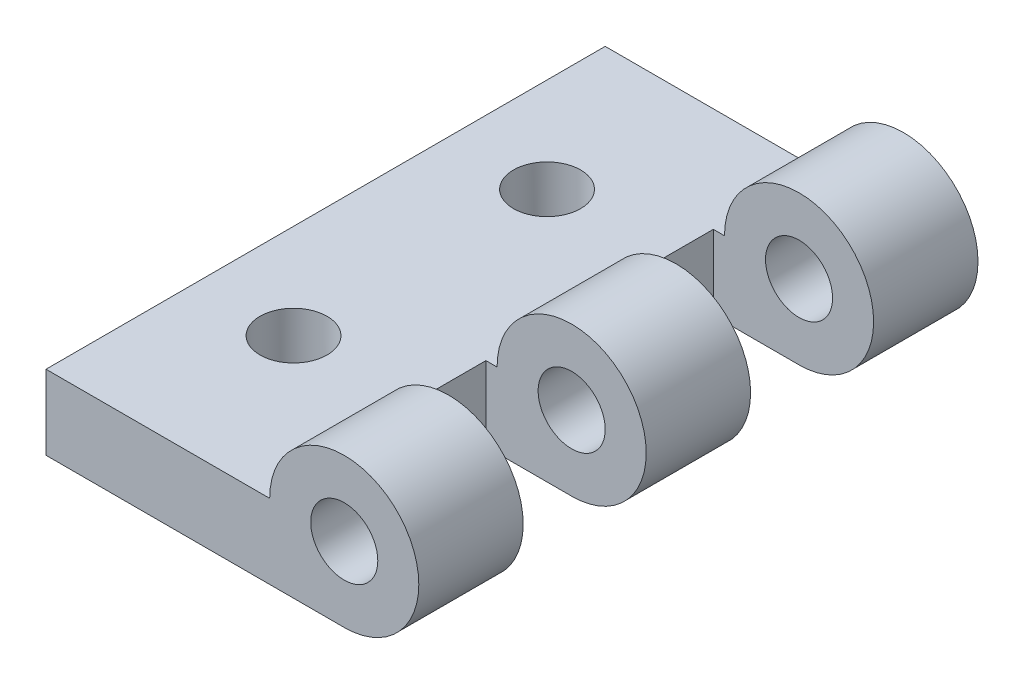
ISO-10303-21;
HEADER;
FILE_DESCRIPTION(('STEP AP214'),'2;1');
FILE_NAME('part.step','',(''),(''),'','','');
FILE_SCHEMA(('AUTOMOTIVE_DESIGN { 1 0 10303 214 1 1 1 1 }'));
ENDSEC;
DATA;
#1=APPLICATION_CONTEXT('core data for automotive mechanical design processes');
#2=APPLICATION_PROTOCOL_DEFINITION('international standard','automotive_design',2000,#1);
#3=PRODUCT_CONTEXT('',#1,'mechanical');
#4=PRODUCT('Part','Part','',(#3));
#5=PRODUCT_RELATED_PRODUCT_CATEGORY('part','',(#4));
#6=PRODUCT_DEFINITION_FORMATION('','',#4);
#7=PRODUCT_DEFINITION_CONTEXT('part definition',#1,'design');
#8=PRODUCT_DEFINITION('design','',#6,#7);
#9=PRODUCT_DEFINITION_SHAPE('','',#8);
#10=(LENGTH_UNIT() NAMED_UNIT(*) SI_UNIT(.MILLI.,.METRE.));
#11=(NAMED_UNIT(*) PLANE_ANGLE_UNIT() SI_UNIT($,.RADIAN.));
#12=(NAMED_UNIT(*) SI_UNIT($,.STERADIAN.) SOLID_ANGLE_UNIT());
#13=UNCERTAINTY_MEASURE_WITH_UNIT(LENGTH_MEASURE(1.E-05),#10,'distance_accuracy_value','');
#14=(GEOMETRIC_REPRESENTATION_CONTEXT(3) GLOBAL_UNCERTAINTY_ASSIGNED_CONTEXT((#13)) GLOBAL_UNIT_ASSIGNED_CONTEXT((#10,
#11,#12)) REPRESENTATION_CONTEXT('',''));
#15=CARTESIAN_POINT('',(0.,0.,0.));
#16=DIRECTION('',(0.,0.,1.));
#17=DIRECTION('',(1.,0.,0.));
#18=AXIS2_PLACEMENT_3D('',#15,#16,#17);
#19=CARTESIAN_POINT('',(20.32,5.08,38.1));
#20=DIRECTION('',(0.,0.,-1.));
#21=DIRECTION('',(-1.,0.,0.));
#22=AXIS2_PLACEMENT_3D('',#19,#20,#21);
#23=CYLINDRICAL_SURFACE('',#22,5.08);
#24=DIRECTION('',(0.,0.,-1.));
#25=VECTOR('',#24,1.);
#26=CARTESIAN_POINT('',(15.24,5.08,38.1));
#27=LINE('',#26,#25);
#28=CARTESIAN_POINT('',(15.24,5.08,7.112));
#29=VERTEX_POINT('',#28);
#30=CARTESIAN_POINT('',(15.24,5.08,0.));
#31=VERTEX_POINT('',#30);
#32=EDGE_CURVE('E252',#29,#31,#27,.T.);
#33=ORIENTED_EDGE('',*,*,#32,.F.);
#34=CARTESIAN_POINT('',(20.32,5.08,7.112));
#35=DIRECTION('',(0.,0.,-1.));
#36=DIRECTION('',(-1.,0.,0.));
#37=AXIS2_PLACEMENT_3D('',#34,#35,#36);
#38=CIRCLE('',#37,5.08);
#39=CARTESIAN_POINT('',(20.32,0.,7.112));
#40=VERTEX_POINT('',#39);
#41=EDGE_CURVE('E209',#29,#40,#38,.T.);
#42=ORIENTED_EDGE('',*,*,#41,.T.);
#43=DIRECTION('',(0.,0.,-1.));
#44=VECTOR('',#43,1.);
#45=CARTESIAN_POINT('',(20.32,0.,38.1));
#46=LINE('',#45,#44);
#47=CARTESIAN_POINT('',(20.32,0.,0.));
#48=VERTEX_POINT('',#47);
#49=EDGE_CURVE('E257',#40,#48,#46,.T.);
#50=ORIENTED_EDGE('',*,*,#49,.T.);
#51=CARTESIAN_POINT('',(20.32,5.08,0.));
#52=DIRECTION('',(0.,0.,1.));
#53=DIRECTION('',(1.,0.,0.));
#54=AXIS2_PLACEMENT_3D('',#51,#52,#53);
#55=CIRCLE('',#54,5.08);
#56=EDGE_CURVE('E243',#48,#31,#55,.T.);
#57=ORIENTED_EDGE('',*,*,#56,.T.);
#58=EDGE_LOOP('',(#33,#42,#50,#57));
#59=FACE_BOUND('',#58,.T.);
#60=ADVANCED_FACE('F39',(#59),#23,.T.);
#61=CARTESIAN_POINT('',(20.32,5.08,15.494));
#62=DIRECTION('',(0.,0.,1.));
#63=DIRECTION('',(1.,0.,0.));
#64=AXIS2_PLACEMENT_3D('',#61,#62,#63);
#65=CIRCLE('',#64,5.08);
#66=CARTESIAN_POINT('',(20.32,0.,15.494));
#67=VERTEX_POINT('',#66);
#68=CARTESIAN_POINT('',(15.24,5.08,15.494));
#69=VERTEX_POINT('',#68);
#70=EDGE_CURVE('E145',#67,#69,#65,.T.);
#71=ORIENTED_EDGE('',*,*,#70,.T.);
#72=CARTESIAN_POINT('',(15.24,5.08,22.606));
#73=VERTEX_POINT('',#72);
#74=EDGE_CURVE('E258',#73,#69,#27,.T.);
#75=ORIENTED_EDGE('',*,*,#74,.F.);
#76=CARTESIAN_POINT('',(20.32,5.08,22.606));
#77=DIRECTION('',(0.,0.,-1.));
#78=DIRECTION('',(-1.,0.,0.));
#79=AXIS2_PLACEMENT_3D('',#76,#77,#78);
#80=CIRCLE('',#79,5.08);
#81=CARTESIAN_POINT('',(20.32,0.,22.606));
#82=VERTEX_POINT('',#81);
#83=EDGE_CURVE('E195',#73,#82,#80,.T.);
#84=ORIENTED_EDGE('',*,*,#83,.T.);
#85=EDGE_CURVE('E264',#82,#67,#46,.T.);
#86=ORIENTED_EDGE('',*,*,#85,.T.);
#87=EDGE_LOOP('',(#71,#75,#84,#86));
#88=FACE_BOUND('',#87,.T.);
#89=ADVANCED_FACE('F315',(#88),#23,.T.);
#90=CARTESIAN_POINT('',(20.32,5.08,38.1));
#91=DIRECTION('',(0.,0.,-1.));
#92=DIRECTION('',(-1.,0.,0.));
#93=AXIS2_PLACEMENT_3D('',#90,#91,#92);
#94=CYLINDRICAL_SURFACE('',#93,2.286);
#95=CARTESIAN_POINT('',(20.32,5.08,7.112));
#96=DIRECTION('',(0.,0.,-1.));
#97=DIRECTION('',(-1.,0.,0.));
#98=AXIS2_PLACEMENT_3D('',#95,#96,#97);
#99=CIRCLE('',#98,2.286);
#100=CARTESIAN_POINT('',(18.034,5.08,7.112));
#101=VERTEX_POINT('',#100);
#102=EDGE_CURVE('E204',#101,#101,#99,.T.);
#103=ORIENTED_EDGE('',*,*,#102,.F.);
#104=EDGE_LOOP('',(#103));
#105=FACE_BOUND('',#104,.T.);
#106=CARTESIAN_POINT('',(20.32,5.08,0.));
#107=DIRECTION('',(0.,0.,1.));
#108=DIRECTION('',(1.,0.,0.));
#109=AXIS2_PLACEMENT_3D('',#106,#107,#108);
#110=CIRCLE('',#109,2.286);
#111=CARTESIAN_POINT('',(22.606,5.08,0.));
#112=VERTEX_POINT('',#111);
#113=EDGE_CURVE('E212',#112,#112,#110,.T.);
#114=ORIENTED_EDGE('',*,*,#113,.F.);
#115=EDGE_LOOP('',(#114));
#116=FACE_BOUND('',#115,.T.);
#117=ADVANCED_FACE('F322',(#105,#116),#94,.F.);
#118=CARTESIAN_POINT('',(20.32,5.08,38.1));
#119=DIRECTION('',(0.,0.,1.));
#120=DIRECTION('',(1.,0.,0.));
#121=AXIS2_PLACEMENT_3D('',#118,#119,#120);
#122=PLANE('',#121);
#123=DIRECTION('',(0.,-1.,0.));
#124=VECTOR('',#123,1.);
#125=CARTESIAN_POINT('',(0.,0.,38.1));
#126=LINE('',#125,#124);
#127=CARTESIAN_POINT('',(0.,5.08,38.1));
#128=VERTEX_POINT('',#127);
#129=CARTESIAN_POINT('',(0.,0.,38.1));
#130=VERTEX_POINT('',#129);
#131=EDGE_CURVE('E221',#128,#130,#126,.T.);
#132=ORIENTED_EDGE('',*,*,#131,.T.);
#133=DIRECTION('',(1.,0.,0.));
#134=VECTOR('',#133,1.);
#135=CARTESIAN_POINT('',(0.,0.,38.1));
#136=LINE('',#135,#134);
#137=CARTESIAN_POINT('',(20.32,0.,38.1));
#138=VERTEX_POINT('',#137);
#139=EDGE_CURVE('E225',#130,#138,#136,.T.);
#140=ORIENTED_EDGE('',*,*,#139,.T.);
#141=CARTESIAN_POINT('',(20.32,5.08,38.1));
#142=DIRECTION('',(0.,0.,1.));
#143=DIRECTION('',(1.,0.,0.));
#144=AXIS2_PLACEMENT_3D('',#141,#142,#143);
#145=CIRCLE('',#144,5.08);
#146=CARTESIAN_POINT('',(15.24,5.08,38.1));
#147=VERTEX_POINT('',#146);
#148=EDGE_CURVE('E229',#138,#147,#145,.T.);
#149=ORIENTED_EDGE('',*,*,#148,.T.);
#150=DIRECTION('',(-1.,0.,0.));
#151=VECTOR('',#150,1.);
#152=CARTESIAN_POINT('',(0.,5.08,38.1));
#153=LINE('',#152,#151);
#154=EDGE_CURVE('E232',#147,#128,#153,.T.);
#155=ORIENTED_EDGE('',*,*,#154,.T.);
#156=EDGE_LOOP('',(#132,#140,#149,#155));
#157=FACE_BOUND('',#156,.T.);
#158=CARTESIAN_POINT('',(20.32,5.08,38.1));
#159=DIRECTION('',(0.,0.,1.));
#160=DIRECTION('',(1.,0.,0.));
#161=AXIS2_PLACEMENT_3D('',#158,#159,#160);
#162=CIRCLE('',#161,2.286);
#163=CARTESIAN_POINT('',(22.606,5.08,38.1));
#164=VERTEX_POINT('',#163);
#165=EDGE_CURVE('E213',#164,#164,#162,.T.);
#166=ORIENTED_EDGE('',*,*,#165,.F.);
#167=EDGE_LOOP('',(#166));
#168=FACE_BOUND('',#167,.T.);
#169=ADVANCED_FACE('F344',(#157,#168),#122,.T.);
#170=CARTESIAN_POINT('',(20.32,5.08,0.));
#171=DIRECTION('',(0.,0.,1.));
#172=DIRECTION('',(1.,0.,0.));
#173=AXIS2_PLACEMENT_3D('',#170,#171,#172);
#174=PLANE('',#173);
#175=DIRECTION('',(0.,-1.,0.));
#176=VECTOR('',#175,1.);
#177=CARTESIAN_POINT('',(0.,0.,0.));
#178=LINE('',#177,#176);
#179=CARTESIAN_POINT('',(0.,5.08,0.));
#180=VERTEX_POINT('',#179);
#181=CARTESIAN_POINT('',(0.,0.,0.));
#182=VERTEX_POINT('',#181);
#183=EDGE_CURVE('E217',#180,#182,#178,.T.);
#184=ORIENTED_EDGE('',*,*,#183,.F.);
#185=DIRECTION('',(-1.,0.,0.));
#186=VECTOR('',#185,1.);
#187=CARTESIAN_POINT('',(0.,5.08,0.));
#188=LINE('',#187,#186);
#189=EDGE_CURVE('E226',#31,#180,#188,.T.);
#190=ORIENTED_EDGE('',*,*,#189,.F.);
#191=ORIENTED_EDGE('',*,*,#56,.F.);
#192=DIRECTION('',(1.,0.,0.));
#193=VECTOR('',#192,1.);
#194=CARTESIAN_POINT('',(0.,0.,0.));
#195=LINE('',#194,#193);
#196=EDGE_CURVE('E239',#182,#48,#195,.T.);
#197=ORIENTED_EDGE('',*,*,#196,.F.);
#198=EDGE_LOOP('',(#184,#190,#191,#197));
#199=FACE_BOUND('',#198,.T.);
#200=ORIENTED_EDGE('',*,*,#113,.T.);
#201=EDGE_LOOP('',(#200));
#202=FACE_BOUND('',#201,.T.);
#203=ADVANCED_FACE('F360',(#199,#202),#174,.F.);
#204=CARTESIAN_POINT('',(0.,0.,38.1));
#205=DIRECTION('',(1.,0.,0.));
#206=DIRECTION('',(0.,0.,-1.));
#207=AXIS2_PLACEMENT_3D('',#204,#205,#206);
#208=PLANE('',#207);
#209=ORIENTED_EDGE('',*,*,#183,.T.);
#210=DIRECTION('',(0.,0.,-1.));
#211=VECTOR('',#210,1.);
#212=CARTESIAN_POINT('',(0.,0.,38.1));
#213=LINE('',#212,#211);
#214=EDGE_CURVE('E263',#130,#182,#213,.T.);
#215=ORIENTED_EDGE('',*,*,#214,.F.);
#216=ORIENTED_EDGE('',*,*,#131,.F.);
#217=DIRECTION('',(0.,0.,-1.));
#218=VECTOR('',#217,1.);
#219=CARTESIAN_POINT('',(0.,5.08,38.1));
#220=LINE('',#219,#218);
#221=EDGE_CURVE('E235',#128,#180,#220,.T.);
#222=ORIENTED_EDGE('',*,*,#221,.T.);
#223=EDGE_LOOP('',(#209,#215,#216,#222));
#224=FACE_BOUND('',#223,.T.);
#225=ADVANCED_FACE('F41',(#224),#208,.F.);
#226=CARTESIAN_POINT('',(0.,0.,38.1));
#227=DIRECTION('',(0.,1.,0.));
#228=DIRECTION('',(0.,0.,1.));
#229=AXIS2_PLACEMENT_3D('',#226,#227,#228);
#230=PLANE('',#229);
#231=CARTESIAN_POINT('',(6.45160000000001,0.,10.414));
#232=DIRECTION('',(0.,1.,0.));
#233=DIRECTION('',(0.,0.,1.));
#234=AXIS2_PLACEMENT_3D('',#231,#232,#233);
#235=CIRCLE('',#234,2.286);
#236=CARTESIAN_POINT('',(6.45160000000001,0.,12.7));
#237=VERTEX_POINT('',#236);
#238=EDGE_CURVE('E285',#237,#237,#235,.T.);
#239=ORIENTED_EDGE('',*,*,#238,.T.);
#240=EDGE_LOOP('',(#239));
#241=FACE_BOUND('',#240,.T.);
#242=CARTESIAN_POINT('',(6.45160000000001,0.,27.686));
#243=DIRECTION('',(0.,1.,0.));
#244=DIRECTION('',(0.,0.,1.));
#245=AXIS2_PLACEMENT_3D('',#242,#243,#244);
#246=CIRCLE('',#245,2.286);
#247=CARTESIAN_POINT('',(6.45160000000001,0.,29.972));
#248=VERTEX_POINT('',#247);
#249=EDGE_CURVE('E161',#248,#248,#246,.T.);
#250=ORIENTED_EDGE('',*,*,#249,.T.);
#251=EDGE_LOOP('',(#250));
#252=FACE_BOUND('',#251,.T.);
#253=ORIENTED_EDGE('',*,*,#49,.F.);
#254=DIRECTION('',(-1.,0.,0.));
#255=VECTOR('',#254,1.);
#256=CARTESIAN_POINT('',(14.478,0.,7.112));
#257=LINE('',#256,#255);
#258=CARTESIAN_POINT('',(14.478,0.,7.112));
#259=VERTEX_POINT('',#258);
#260=EDGE_CURVE('E140',#40,#259,#257,.T.);
#261=ORIENTED_EDGE('',*,*,#260,.T.);
#262=DIRECTION('',(0.,0.,1.));
#263=VECTOR('',#262,1.);
#264=CARTESIAN_POINT('',(14.478,0.,7.112));
#265=LINE('',#264,#263);
#266=CARTESIAN_POINT('',(14.478,0.,15.494));
#267=VERTEX_POINT('',#266);
#268=EDGE_CURVE('E135',#259,#267,#265,.T.);
#269=ORIENTED_EDGE('',*,*,#268,.T.);
#270=DIRECTION('',(1.,0.,0.));
#271=VECTOR('',#270,1.);
#272=CARTESIAN_POINT('',(14.478,0.,15.494));
#273=LINE('',#272,#271);
#274=EDGE_CURVE('E143',#267,#67,#273,.T.);
#275=ORIENTED_EDGE('',*,*,#274,.T.);
#276=ORIENTED_EDGE('',*,*,#85,.F.);
#277=DIRECTION('',(-1.,0.,0.));
#278=VECTOR('',#277,1.);
#279=CARTESIAN_POINT('',(14.478,0.,22.606));
#280=LINE('',#279,#278);
#281=CARTESIAN_POINT('',(14.478,0.,22.606));
#282=VERTEX_POINT('',#281);
#283=EDGE_CURVE('E177',#82,#282,#280,.T.);
#284=ORIENTED_EDGE('',*,*,#283,.T.);
#285=DIRECTION('',(0.,0.,1.));
#286=VECTOR('',#285,1.);
#287=CARTESIAN_POINT('',(14.478,0.,22.606));
#288=LINE('',#287,#286);
#289=CARTESIAN_POINT('',(14.478,0.,30.988));
#290=VERTEX_POINT('',#289);
#291=EDGE_CURVE('E169',#282,#290,#288,.T.);
#292=ORIENTED_EDGE('',*,*,#291,.T.);
#293=DIRECTION('',(1.,0.,0.));
#294=VECTOR('',#293,1.);
#295=CARTESIAN_POINT('',(14.478,0.,30.988));
#296=LINE('',#295,#294);
#297=CARTESIAN_POINT('',(20.32,0.,30.988));
#298=VERTEX_POINT('',#297);
#299=EDGE_CURVE('E173',#290,#298,#296,.T.);
#300=ORIENTED_EDGE('',*,*,#299,.T.);
#301=EDGE_CURVE('E259',#138,#298,#46,.T.);
#302=ORIENTED_EDGE('',*,*,#301,.F.);
#303=ORIENTED_EDGE('',*,*,#139,.F.);
#304=ORIENTED_EDGE('',*,*,#214,.T.);
#305=ORIENTED_EDGE('',*,*,#196,.T.);
#306=EDGE_LOOP('',(#253,#261,#269,#275,#276,#284,#292,#300,#302,#303,#304,#305));
#307=FACE_BOUND('',#306,.T.);
#308=ADVANCED_FACE('F152',(#241,#252,#307),#230,.F.);
#309=CARTESIAN_POINT('',(20.32,5.08,30.988));
#310=DIRECTION('',(0.,0.,1.));
#311=DIRECTION('',(1.,0.,0.));
#312=AXIS2_PLACEMENT_3D('',#309,#310,#311);
#313=CIRCLE('',#312,5.08);
#314=CARTESIAN_POINT('',(15.24,5.08,30.988));
#315=VERTEX_POINT('',#314);
#316=EDGE_CURVE('E187',#298,#315,#313,.T.);
#317=ORIENTED_EDGE('',*,*,#316,.T.);
#318=EDGE_CURVE('E253',#147,#315,#27,.T.);
#319=ORIENTED_EDGE('',*,*,#318,.F.);
#320=ORIENTED_EDGE('',*,*,#148,.F.);
#321=ORIENTED_EDGE('',*,*,#301,.T.);
#322=EDGE_LOOP('',(#317,#319,#320,#321));
#323=FACE_BOUND('',#322,.T.);
#324=ADVANCED_FACE('F318',(#323),#23,.T.);
#325=CARTESIAN_POINT('',(0.,5.08,38.1));
#326=DIRECTION('',(0.,-1.,0.));
#327=DIRECTION('',(0.,0.,-1.));
#328=AXIS2_PLACEMENT_3D('',#325,#326,#327);
#329=PLANE('',#328);
#330=CARTESIAN_POINT('',(6.45160000000001,5.08,10.414));
#331=DIRECTION('',(0.,-1.,0.));
#332=DIRECTION('',(0.,0.,-1.));
#333=AXIS2_PLACEMENT_3D('',#330,#331,#332);
#334=CIRCLE('',#333,2.286);
#335=CARTESIAN_POINT('',(6.45160000000001,5.08,8.128));
#336=VERTEX_POINT('',#335);
#337=EDGE_CURVE('E43',#336,#336,#334,.T.);
#338=ORIENTED_EDGE('',*,*,#337,.T.);
#339=EDGE_LOOP('',(#338));
#340=FACE_BOUND('',#339,.T.);
#341=CARTESIAN_POINT('',(6.45160000000001,5.08,27.686));
#342=DIRECTION('',(0.,-1.,0.));
#343=DIRECTION('',(0.,0.,-1.));
#344=AXIS2_PLACEMENT_3D('',#341,#342,#343);
#345=CIRCLE('',#344,2.286);
#346=CARTESIAN_POINT('',(6.45160000000001,5.08,25.4));
#347=VERTEX_POINT('',#346);
#348=EDGE_CURVE('E282',#347,#347,#345,.T.);
#349=ORIENTED_EDGE('',*,*,#348,.T.);
#350=EDGE_LOOP('',(#349));
#351=FACE_BOUND('',#350,.T.);
#352=DIRECTION('',(0.,0.,-1.));
#353=VECTOR('',#352,1.);
#354=CARTESIAN_POINT('',(14.478,5.08,38.1));
#355=LINE('',#354,#353);
#356=CARTESIAN_POINT('',(14.478,5.08,15.494));
#357=VERTEX_POINT('',#356);
#358=CARTESIAN_POINT('',(14.478,5.08,7.112));
#359=VERTEX_POINT('',#358);
#360=EDGE_CURVE('E11',#357,#359,#355,.T.);
#361=ORIENTED_EDGE('',*,*,#360,.T.);
#362=DIRECTION('',(1.,0.,0.));
#363=VECTOR('',#362,1.);
#364=CARTESIAN_POINT('',(0.,5.08,7.112));
#365=LINE('',#364,#363);
#366=EDGE_CURVE('E205',#359,#29,#365,.T.);
#367=ORIENTED_EDGE('',*,*,#366,.T.);
#368=ORIENTED_EDGE('',*,*,#32,.T.);
#369=ORIENTED_EDGE('',*,*,#189,.T.);
#370=ORIENTED_EDGE('',*,*,#221,.F.);
#371=ORIENTED_EDGE('',*,*,#154,.F.);
#372=ORIENTED_EDGE('',*,*,#318,.T.);
#373=DIRECTION('',(-1.,0.,0.));
#374=VECTOR('',#373,1.);
#375=CARTESIAN_POINT('',(0.,5.08,30.988));
#376=LINE('',#375,#374);
#377=CARTESIAN_POINT('',(14.478,5.08,30.988));
#378=VERTEX_POINT('',#377);
#379=EDGE_CURVE('E183',#315,#378,#376,.T.);
#380=ORIENTED_EDGE('',*,*,#379,.T.);
#381=DIRECTION('',(0.,0.,-1.));
#382=VECTOR('',#381,1.);
#383=CARTESIAN_POINT('',(14.478,5.08,38.1));
#384=LINE('',#383,#382);
#385=CARTESIAN_POINT('',(14.478,5.08,22.606));
#386=VERTEX_POINT('',#385);
#387=EDGE_CURVE('E49',#378,#386,#384,.T.);
#388=ORIENTED_EDGE('',*,*,#387,.T.);
#389=DIRECTION('',(1.,0.,0.));
#390=VECTOR('',#389,1.);
#391=CARTESIAN_POINT('',(0.,5.08,22.606));
#392=LINE('',#391,#390);
#393=EDGE_CURVE('E191',#386,#73,#392,.T.);
#394=ORIENTED_EDGE('',*,*,#393,.T.);
#395=ORIENTED_EDGE('',*,*,#74,.T.);
#396=DIRECTION('',(-1.,0.,0.));
#397=VECTOR('',#396,1.);
#398=CARTESIAN_POINT('',(0.,5.08,15.494));
#399=LINE('',#398,#397);
#400=EDGE_CURVE('E199',#69,#357,#399,.T.);
#401=ORIENTED_EDGE('',*,*,#400,.T.);
#402=EDGE_LOOP('',(#361,#367,#368,#369,#370,#371,#372,#380,#388,#394,#395,#401));
#403=FACE_BOUND('',#402,.T.);
#404=ADVANCED_FACE('F327',(#340,#351,#403),#329,.F.);
#405=CARTESIAN_POINT('',(20.32,5.08,30.988));
#406=DIRECTION('',(0.,0.,1.));
#407=DIRECTION('',(1.,0.,0.));
#408=AXIS2_PLACEMENT_3D('',#405,#406,#407);
#409=CIRCLE('',#408,2.286);
#410=CARTESIAN_POINT('',(22.606,5.08,30.988));
#411=VERTEX_POINT('',#410);
#412=EDGE_CURVE('E167',#411,#411,#409,.T.);
#413=ORIENTED_EDGE('',*,*,#412,.F.);
#414=EDGE_LOOP('',(#413));
#415=FACE_BOUND('',#414,.T.);
#416=ORIENTED_EDGE('',*,*,#165,.T.);
#417=EDGE_LOOP('',(#416));
#418=FACE_BOUND('',#417,.T.);
#419=ADVANCED_FACE('F333',(#415,#418),#94,.F.);
#420=CARTESIAN_POINT('',(14.478,0.,22.606));
#421=DIRECTION('',(-1.,0.,0.));
#422=DIRECTION('',(0.,0.,1.));
#423=AXIS2_PLACEMENT_3D('',#420,#421,#422);
#424=PLANE('',#423);
#425=DIRECTION('',(0.,1.,0.));
#426=VECTOR('',#425,1.);
#427=CARTESIAN_POINT('',(14.478,0.,30.988));
#428=LINE('',#427,#426);
#429=EDGE_CURVE('E65',#290,#378,#428,.T.);
#430=ORIENTED_EDGE('',*,*,#429,.F.);
#431=ORIENTED_EDGE('',*,*,#291,.F.);
#432=DIRECTION('',(0.,1.,0.));
#433=VECTOR('',#432,1.);
#434=CARTESIAN_POINT('',(14.478,0.,22.606));
#435=LINE('',#434,#433);
#436=EDGE_CURVE('E155',#282,#386,#435,.T.);
#437=ORIENTED_EDGE('',*,*,#436,.T.);
#438=ORIENTED_EDGE('',*,*,#387,.F.);
#439=EDGE_LOOP('',(#430,#431,#437,#438));
#440=FACE_BOUND('',#439,.T.);
#441=ADVANCED_FACE('F350',(#440),#424,.F.);
#442=CARTESIAN_POINT('',(14.478,0.,22.606));
#443=DIRECTION('',(0.,0.,-1.));
#444=DIRECTION('',(-1.,0.,0.));
#445=AXIS2_PLACEMENT_3D('',#442,#443,#444);
#446=PLANE('',#445);
#447=CARTESIAN_POINT('',(20.32,5.08,22.606));
#448=DIRECTION('',(0.,0.,-1.));
#449=DIRECTION('',(-1.,0.,0.));
#450=AXIS2_PLACEMENT_3D('',#447,#448,#449);
#451=CIRCLE('',#450,2.286);
#452=CARTESIAN_POINT('',(18.034,5.08,22.606));
#453=VERTEX_POINT('',#452);
#454=EDGE_CURVE('E190',#453,#453,#451,.T.);
#455=ORIENTED_EDGE('',*,*,#454,.T.);
#456=EDGE_LOOP('',(#455));
#457=FACE_BOUND('',#456,.T.);
#458=ORIENTED_EDGE('',*,*,#83,.F.);
#459=ORIENTED_EDGE('',*,*,#393,.F.);
#460=ORIENTED_EDGE('',*,*,#436,.F.);
#461=ORIENTED_EDGE('',*,*,#283,.F.);
#462=EDGE_LOOP('',(#458,#459,#460,#461));
#463=FACE_BOUND('',#462,.T.);
#464=ADVANCED_FACE('F381',(#457,#463),#446,.F.);
#465=CARTESIAN_POINT('',(14.478,0.,30.988));
#466=DIRECTION('',(0.,0.,1.));
#467=DIRECTION('',(1.,0.,0.));
#468=AXIS2_PLACEMENT_3D('',#465,#466,#467);
#469=PLANE('',#468);
#470=ORIENTED_EDGE('',*,*,#412,.T.);
#471=EDGE_LOOP('',(#470));
#472=FACE_BOUND('',#471,.T.);
#473=ORIENTED_EDGE('',*,*,#299,.F.);
#474=ORIENTED_EDGE('',*,*,#429,.T.);
#475=ORIENTED_EDGE('',*,*,#379,.F.);
#476=ORIENTED_EDGE('',*,*,#316,.F.);
#477=EDGE_LOOP('',(#473,#474,#475,#476));
#478=FACE_BOUND('',#477,.T.);
#479=ADVANCED_FACE('F339',(#472,#478),#469,.F.);
#480=CARTESIAN_POINT('',(20.32,5.08,15.494));
#481=DIRECTION('',(0.,0.,1.));
#482=DIRECTION('',(1.,0.,0.));
#483=AXIS2_PLACEMENT_3D('',#480,#481,#482);
#484=CIRCLE('',#483,2.286);
#485=CARTESIAN_POINT('',(22.606,5.08,15.494));
#486=VERTEX_POINT('',#485);
#487=EDGE_CURVE('E198',#486,#486,#484,.T.);
#488=ORIENTED_EDGE('',*,*,#487,.F.);
#489=EDGE_LOOP('',(#488));
#490=FACE_BOUND('',#489,.T.);
#491=ORIENTED_EDGE('',*,*,#454,.F.);
#492=EDGE_LOOP('',(#491));
#493=FACE_BOUND('',#492,.T.);
#494=ADVANCED_FACE('F378',(#490,#493),#94,.F.);
#495=CARTESIAN_POINT('',(14.478,0.,7.112));
#496=DIRECTION('',(-1.,0.,0.));
#497=DIRECTION('',(0.,0.,1.));
#498=AXIS2_PLACEMENT_3D('',#495,#496,#497);
#499=PLANE('',#498);
#500=DIRECTION('',(0.,1.,0.));
#501=VECTOR('',#500,1.);
#502=CARTESIAN_POINT('',(14.478,0.,15.494));
#503=LINE('',#502,#501);
#504=EDGE_CURVE('E57',#267,#357,#503,.T.);
#505=ORIENTED_EDGE('',*,*,#504,.F.);
#506=ORIENTED_EDGE('',*,*,#268,.F.);
#507=DIRECTION('',(0.,1.,0.));
#508=VECTOR('',#507,1.);
#509=CARTESIAN_POINT('',(14.478,0.,7.112));
#510=LINE('',#509,#508);
#511=EDGE_CURVE('E139',#259,#359,#510,.T.);
#512=ORIENTED_EDGE('',*,*,#511,.T.);
#513=ORIENTED_EDGE('',*,*,#360,.F.);
#514=EDGE_LOOP('',(#505,#506,#512,#513));
#515=FACE_BOUND('',#514,.T.);
#516=ADVANCED_FACE('F132',(#515),#499,.F.);
#517=CARTESIAN_POINT('',(14.478,0.,7.112));
#518=DIRECTION('',(0.,0.,-1.));
#519=DIRECTION('',(-1.,0.,0.));
#520=AXIS2_PLACEMENT_3D('',#517,#518,#519);
#521=PLANE('',#520);
#522=ORIENTED_EDGE('',*,*,#102,.T.);
#523=EDGE_LOOP('',(#522));
#524=FACE_BOUND('',#523,.T.);
#525=ORIENTED_EDGE('',*,*,#41,.F.);
#526=ORIENTED_EDGE('',*,*,#366,.F.);
#527=ORIENTED_EDGE('',*,*,#511,.F.);
#528=ORIENTED_EDGE('',*,*,#260,.F.);
#529=EDGE_LOOP('',(#525,#526,#527,#528));
#530=FACE_BOUND('',#529,.T.);
#531=ADVANCED_FACE('F310',(#524,#530),#521,.F.);
#532=CARTESIAN_POINT('',(14.478,0.,15.494));
#533=DIRECTION('',(0.,0.,1.));
#534=DIRECTION('',(1.,0.,0.));
#535=AXIS2_PLACEMENT_3D('',#532,#533,#534);
#536=PLANE('',#535);
#537=ORIENTED_EDGE('',*,*,#487,.T.);
#538=EDGE_LOOP('',(#537));
#539=FACE_BOUND('',#538,.T.);
#540=ORIENTED_EDGE('',*,*,#274,.F.);
#541=ORIENTED_EDGE('',*,*,#504,.T.);
#542=ORIENTED_EDGE('',*,*,#400,.F.);
#543=ORIENTED_EDGE('',*,*,#70,.F.);
#544=EDGE_LOOP('',(#540,#541,#542,#543));
#545=FACE_BOUND('',#544,.T.);
#546=ADVANCED_FACE('F144',(#539,#545),#536,.F.);
#547=CARTESIAN_POINT('',(6.45160000000001,0.,27.686));
#548=DIRECTION('',(0.,1.,0.));
#549=DIRECTION('',(0.,0.,1.));
#550=AXIS2_PLACEMENT_3D('',#547,#548,#549);
#551=CYLINDRICAL_SURFACE('',#550,2.286);
#552=ORIENTED_EDGE('',*,*,#249,.F.);
#553=EDGE_LOOP('',(#552));
#554=FACE_BOUND('',#553,.T.);
#555=ORIENTED_EDGE('',*,*,#348,.F.);
#556=EDGE_LOOP('',(#555));
#557=FACE_BOUND('',#556,.T.);
#558=ADVANCED_FACE('F299',(#554,#557),#551,.F.);
#559=CARTESIAN_POINT('',(6.45160000000001,0.,10.414));
#560=DIRECTION('',(0.,1.,0.));
#561=DIRECTION('',(0.,0.,1.));
#562=AXIS2_PLACEMENT_3D('',#559,#560,#561);
#563=CYLINDRICAL_SURFACE('',#562,2.286);
#564=ORIENTED_EDGE('',*,*,#238,.F.);
#565=EDGE_LOOP('',(#564));
#566=FACE_BOUND('',#565,.T.);
#567=ORIENTED_EDGE('',*,*,#337,.F.);
#568=EDGE_LOOP('',(#567));
#569=FACE_BOUND('',#568,.T.);
#570=ADVANCED_FACE('F302',(#566,#569),#563,.F.);
#571=CLOSED_SHELL('',(#60,#89,#117,#169,#203,#225,#308,#324,#404,#419,#441,#464,#479,#494,#516,
#531,#546,#558,#570));
#572=MANIFOLD_SOLID_BREP('B2',#571);
#573=ADVANCED_BREP_SHAPE_REPRESENTATION('',(#18,#572),#14);
#574=SHAPE_DEFINITION_REPRESENTATION(#9,#573);
ENDSEC;
END-ISO-10303-21;
